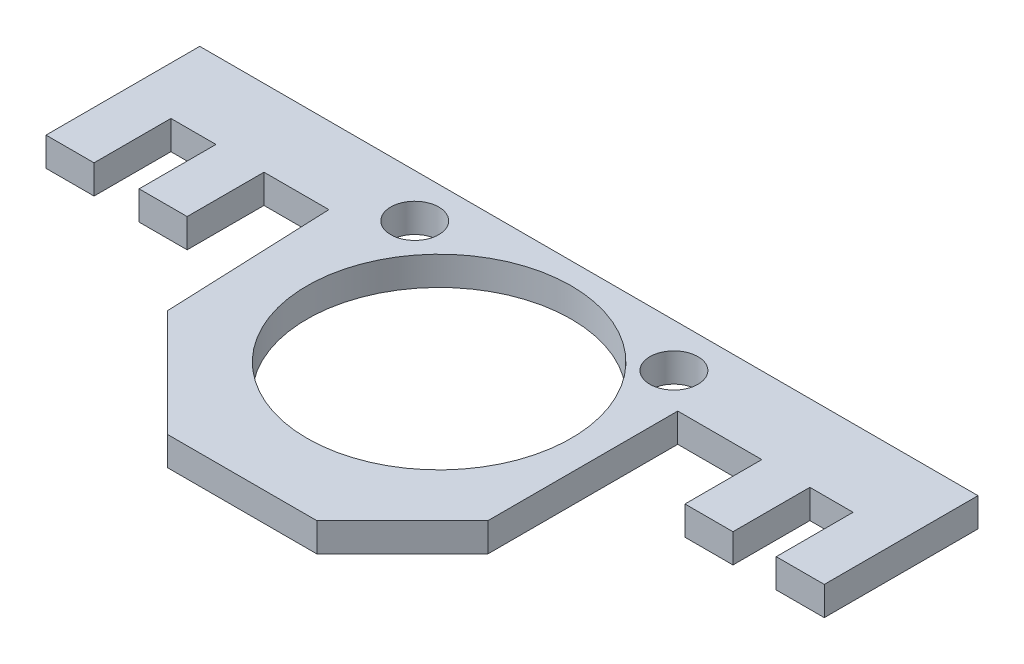
ISO-10303-21;
HEADER;
FILE_DESCRIPTION(('STEP AP214'),'2;1');
FILE_NAME('part.step','',(''),(''),'','','');
FILE_SCHEMA(('AUTOMOTIVE_DESIGN { 1 0 10303 214 1 1 1 1 }'));
ENDSEC;
DATA;
#1=APPLICATION_CONTEXT('core data for automotive mechanical design processes');
#2=APPLICATION_PROTOCOL_DEFINITION('international standard','automotive_design',2000,#1);
#3=PRODUCT_CONTEXT('',#1,'mechanical');
#4=PRODUCT('Part','Part','',(#3));
#5=PRODUCT_RELATED_PRODUCT_CATEGORY('part','',(#4));
#6=PRODUCT_DEFINITION_FORMATION('','',#4);
#7=PRODUCT_DEFINITION_CONTEXT('part definition',#1,'design');
#8=PRODUCT_DEFINITION('design','',#6,#7);
#9=PRODUCT_DEFINITION_SHAPE('','',#8);
#10=(LENGTH_UNIT() NAMED_UNIT(*) SI_UNIT(.MILLI.,.METRE.));
#11=(NAMED_UNIT(*) PLANE_ANGLE_UNIT() SI_UNIT($,.RADIAN.));
#12=(NAMED_UNIT(*) SI_UNIT($,.STERADIAN.) SOLID_ANGLE_UNIT());
#13=UNCERTAINTY_MEASURE_WITH_UNIT(LENGTH_MEASURE(1.E-05),#10,'distance_accuracy_value','');
#14=(GEOMETRIC_REPRESENTATION_CONTEXT(3) GLOBAL_UNCERTAINTY_ASSIGNED_CONTEXT((#13)) GLOBAL_UNIT_ASSIGNED_CONTEXT((#10,
#11,#12)) REPRESENTATION_CONTEXT('',''));
#15=CARTESIAN_POINT('',(0.,0.,0.));
#16=DIRECTION('',(0.,0.,1.));
#17=DIRECTION('',(1.,0.,0.));
#18=AXIS2_PLACEMENT_3D('',#15,#16,#17);
#19=CARTESIAN_POINT('',(-54.5898693639006,1.2,-21.7003312481757));
#20=DIRECTION('',(1.,0.,0.));
#21=DIRECTION('',(0.,0.,-1.));
#22=AXIS2_PLACEMENT_3D('',#19,#20,#21);
#23=PLANE('',#22);
#24=DIRECTION('',(0.,0.,1.));
#25=VECTOR('',#24,1.);
#26=CARTESIAN_POINT('',(-54.5898693639006,0.,-21.7003312481757));
#27=LINE('',#26,#25);
#28=CARTESIAN_POINT('',(-54.5898693639006,0.,-21.7003312481757));
#29=VERTEX_POINT('',#28);
#30=CARTESIAN_POINT('',(-54.5898693639006,0.,-15.3003312481757));
#31=VERTEX_POINT('',#30);
#32=EDGE_CURVE('E212',#29,#31,#27,.T.);
#33=ORIENTED_EDGE('',*,*,#32,.T.);
#34=DIRECTION('',(0.,-1.,0.));
#35=VECTOR('',#34,1.);
#36=CARTESIAN_POINT('',(-54.5898693639006,1.2,-15.3003312481757));
#37=LINE('',#36,#35);
#38=CARTESIAN_POINT('',(-54.5898693639006,1.2,-15.3003312481757));
#39=VERTEX_POINT('',#38);
#40=EDGE_CURVE('E11',#39,#31,#37,.T.);
#41=ORIENTED_EDGE('',*,*,#40,.F.);
#42=DIRECTION('',(0.,0.,1.));
#43=VECTOR('',#42,1.);
#44=CARTESIAN_POINT('',(-54.5898693639006,1.2,-21.7003312481757));
#45=LINE('',#44,#43);
#46=CARTESIAN_POINT('',(-54.5898693639006,1.2,-21.7003312481757));
#47=VERTEX_POINT('',#46);
#48=EDGE_CURVE('E255',#47,#39,#45,.T.);
#49=ORIENTED_EDGE('',*,*,#48,.F.);
#50=DIRECTION('',(0.,-1.,0.));
#51=VECTOR('',#50,1.);
#52=CARTESIAN_POINT('',(-54.5898693639006,1.2,-21.7003312481757));
#53=LINE('',#52,#51);
#54=EDGE_CURVE('E208',#47,#29,#53,.T.);
#55=ORIENTED_EDGE('',*,*,#54,.T.);
#56=EDGE_LOOP('',(#33,#41,#49,#55));
#57=FACE_BOUND('',#56,.T.);
#58=ADVANCED_FACE('F32',(#57),#23,.F.);
#59=CARTESIAN_POINT('',(-54.5898693639006,1.2,-15.3003312481757));
#60=DIRECTION('',(0.,0.,-1.));
#61=DIRECTION('',(-1.,0.,0.));
#62=AXIS2_PLACEMENT_3D('',#59,#60,#61);
#63=PLANE('',#62);
#64=DIRECTION('',(1.,0.,0.));
#65=VECTOR('',#64,1.);
#66=CARTESIAN_POINT('',(-54.5898693639006,0.,-15.3003312481757));
#67=LINE('',#66,#65);
#68=CARTESIAN_POINT('',(-52.5898693639006,0.,-15.3003312481757));
#69=VERTEX_POINT('',#68);
#70=EDGE_CURVE('E215',#31,#69,#67,.T.);
#71=ORIENTED_EDGE('',*,*,#70,.T.);
#72=DIRECTION('',(0.,-1.,0.));
#73=VECTOR('',#72,1.);
#74=CARTESIAN_POINT('',(-52.5898693639006,1.2,-15.3003312481757));
#75=LINE('',#74,#73);
#76=CARTESIAN_POINT('',(-52.5898693639006,1.2,-15.3003312481757));
#77=VERTEX_POINT('',#76);
#78=EDGE_CURVE('E40',#77,#69,#75,.T.);
#79=ORIENTED_EDGE('',*,*,#78,.F.);
#80=DIRECTION('',(1.,0.,0.));
#81=VECTOR('',#80,1.);
#82=CARTESIAN_POINT('',(-54.5898693639006,1.2,-15.3003312481757));
#83=LINE('',#82,#81);
#84=EDGE_CURVE('E133',#39,#77,#83,.T.);
#85=ORIENTED_EDGE('',*,*,#84,.F.);
#86=ORIENTED_EDGE('',*,*,#40,.T.);
#87=EDGE_LOOP('',(#71,#79,#85,#86));
#88=FACE_BOUND('',#87,.T.);
#89=ADVANCED_FACE('F384',(#88),#63,.F.);
#90=CARTESIAN_POINT('',(-52.5898693639006,1.2,-15.3003312481757));
#91=DIRECTION('',(-1.,0.,0.));
#92=DIRECTION('',(0.,0.,1.));
#93=AXIS2_PLACEMENT_3D('',#90,#91,#92);
#94=PLANE('',#93);
#95=DIRECTION('',(0.,0.,-1.));
#96=VECTOR('',#95,1.);
#97=CARTESIAN_POINT('',(-52.5898693639006,0.,-15.3003312481757));
#98=LINE('',#97,#96);
#99=CARTESIAN_POINT('',(-52.5898693639006,0.,-18.5003312481757));
#100=VERTEX_POINT('',#99);
#101=EDGE_CURVE('E218',#69,#100,#98,.T.);
#102=ORIENTED_EDGE('',*,*,#101,.T.);
#103=DIRECTION('',(0.,-1.,0.));
#104=VECTOR('',#103,1.);
#105=CARTESIAN_POINT('',(-52.5898693639006,1.2,-18.5003312481757));
#106=LINE('',#105,#104);
#107=CARTESIAN_POINT('',(-52.5898693639006,1.2,-18.5003312481757));
#108=VERTEX_POINT('',#107);
#109=EDGE_CURVE('E304',#108,#100,#106,.T.);
#110=ORIENTED_EDGE('',*,*,#109,.F.);
#111=DIRECTION('',(0.,0.,-1.));
#112=VECTOR('',#111,1.);
#113=CARTESIAN_POINT('',(-52.5898693639006,1.2,-15.3003312481757));
#114=LINE('',#113,#112);
#115=EDGE_CURVE('E312',#77,#108,#114,.T.);
#116=ORIENTED_EDGE('',*,*,#115,.F.);
#117=ORIENTED_EDGE('',*,*,#78,.T.);
#118=EDGE_LOOP('',(#102,#110,#116,#117));
#119=FACE_BOUND('',#118,.T.);
#120=ADVANCED_FACE('F310',(#119),#94,.F.);
#121=CARTESIAN_POINT('',(-52.5898693639006,1.2,-18.5003312481757));
#122=DIRECTION('',(0.,0.,-1.));
#123=DIRECTION('',(-1.,0.,0.));
#124=AXIS2_PLACEMENT_3D('',#121,#122,#123);
#125=PLANE('',#124);
#126=DIRECTION('',(1.,0.,0.));
#127=VECTOR('',#126,1.);
#128=CARTESIAN_POINT('',(-52.5898693639006,0.,-18.5003312481757));
#129=LINE('',#128,#127);
#130=CARTESIAN_POINT('',(-50.7139819287559,0.,-18.5003312481757));
#131=VERTEX_POINT('',#130);
#132=EDGE_CURVE('E220',#100,#131,#129,.T.);
#133=ORIENTED_EDGE('',*,*,#132,.T.);
#134=DIRECTION('',(0.,-1.,0.));
#135=VECTOR('',#134,1.);
#136=CARTESIAN_POINT('',(-50.7139819287559,1.2,-18.5003312481757));
#137=LINE('',#136,#135);
#138=CARTESIAN_POINT('',(-50.7139819287559,1.2,-18.5003312481757));
#139=VERTEX_POINT('',#138);
#140=EDGE_CURVE('E301',#139,#131,#137,.T.);
#141=ORIENTED_EDGE('',*,*,#140,.F.);
#142=DIRECTION('',(1.,0.,0.));
#143=VECTOR('',#142,1.);
#144=CARTESIAN_POINT('',(-52.5898693639006,1.2,-18.5003312481757));
#145=LINE('',#144,#143);
#146=EDGE_CURVE('E330',#108,#139,#145,.T.);
#147=ORIENTED_EDGE('',*,*,#146,.F.);
#148=ORIENTED_EDGE('',*,*,#109,.T.);
#149=EDGE_LOOP('',(#133,#141,#147,#148));
#150=FACE_BOUND('',#149,.T.);
#151=ADVANCED_FACE('F321',(#150),#125,.F.);
#152=CARTESIAN_POINT('',(-50.7139819287559,1.2,-18.5003312481757));
#153=DIRECTION('',(1.,0.,0.));
#154=DIRECTION('',(0.,0.,-1.));
#155=AXIS2_PLACEMENT_3D('',#152,#153,#154);
#156=PLANE('',#155);
#157=DIRECTION('',(0.,0.,1.));
#158=VECTOR('',#157,1.);
#159=CARTESIAN_POINT('',(-50.7139819287559,0.,-18.5003312481757));
#160=LINE('',#159,#158);
#161=CARTESIAN_POINT('',(-50.7139819287559,0.,-15.3003312481757));
#162=VERTEX_POINT('',#161);
#163=EDGE_CURVE('E222',#131,#162,#160,.T.);
#164=ORIENTED_EDGE('',*,*,#163,.T.);
#165=DIRECTION('',(0.,-1.,0.));
#166=VECTOR('',#165,1.);
#167=CARTESIAN_POINT('',(-50.7139819287559,1.2,-15.3003312481757));
#168=LINE('',#167,#166);
#169=CARTESIAN_POINT('',(-50.7139819287559,1.2,-15.3003312481757));
#170=VERTEX_POINT('',#169);
#171=EDGE_CURVE('E298',#170,#162,#168,.T.);
#172=ORIENTED_EDGE('',*,*,#171,.F.);
#173=DIRECTION('',(0.,0.,1.));
#174=VECTOR('',#173,1.);
#175=CARTESIAN_POINT('',(-50.7139819287559,1.2,-18.5003312481757));
#176=LINE('',#175,#174);
#177=EDGE_CURVE('E327',#139,#170,#176,.T.);
#178=ORIENTED_EDGE('',*,*,#177,.F.);
#179=ORIENTED_EDGE('',*,*,#140,.T.);
#180=EDGE_LOOP('',(#164,#172,#178,#179));
#181=FACE_BOUND('',#180,.T.);
#182=ADVANCED_FACE('F325',(#181),#156,.F.);
#183=CARTESIAN_POINT('',(-50.7139819287559,1.2,-15.3003312481757));
#184=DIRECTION('',(0.,0.,-1.));
#185=DIRECTION('',(-1.,0.,0.));
#186=AXIS2_PLACEMENT_3D('',#183,#184,#185);
#187=PLANE('',#186);
#188=DIRECTION('',(1.,0.,0.));
#189=VECTOR('',#188,1.);
#190=CARTESIAN_POINT('',(-50.7139819287559,0.,-15.3003312481757));
#191=LINE('',#190,#189);
#192=CARTESIAN_POINT('',(-48.7139819287559,0.,-15.3003312481757));
#193=VERTEX_POINT('',#192);
#194=EDGE_CURVE('E224',#162,#193,#191,.T.);
#195=ORIENTED_EDGE('',*,*,#194,.T.);
#196=DIRECTION('',(0.,-1.,0.));
#197=VECTOR('',#196,1.);
#198=CARTESIAN_POINT('',(-48.7139819287559,1.2,-15.3003312481757));
#199=LINE('',#198,#197);
#200=CARTESIAN_POINT('',(-48.7139819287559,1.2,-15.3003312481757));
#201=VERTEX_POINT('',#200);
#202=EDGE_CURVE('E295',#201,#193,#199,.T.);
#203=ORIENTED_EDGE('',*,*,#202,.F.);
#204=DIRECTION('',(1.,0.,0.));
#205=VECTOR('',#204,1.);
#206=CARTESIAN_POINT('',(-50.7139819287559,1.2,-15.3003312481757));
#207=LINE('',#206,#205);
#208=EDGE_CURVE('E329',#170,#201,#207,.T.);
#209=ORIENTED_EDGE('',*,*,#208,.F.);
#210=ORIENTED_EDGE('',*,*,#171,.T.);
#211=EDGE_LOOP('',(#195,#203,#209,#210));
#212=FACE_BOUND('',#211,.T.);
#213=ADVANCED_FACE('F397',(#212),#187,.F.);
#214=CARTESIAN_POINT('',(-48.7139819287559,1.2,-15.3003312481757));
#215=DIRECTION('',(-1.,0.,0.));
#216=DIRECTION('',(0.,0.,1.));
#217=AXIS2_PLACEMENT_3D('',#214,#215,#216);
#218=PLANE('',#217);
#219=DIRECTION('',(0.,0.,-1.));
#220=VECTOR('',#219,1.);
#221=CARTESIAN_POINT('',(-48.7139819287559,0.,-15.3003312481757));
#222=LINE('',#221,#220);
#223=CARTESIAN_POINT('',(-48.7139819287559,0.,-18.5003312481757));
#224=VERTEX_POINT('',#223);
#225=EDGE_CURVE('E226',#193,#224,#222,.T.);
#226=ORIENTED_EDGE('',*,*,#225,.T.);
#227=DIRECTION('',(0.,-1.,0.));
#228=VECTOR('',#227,1.);
#229=CARTESIAN_POINT('',(-48.7139819287559,1.2,-18.5003312481757));
#230=LINE('',#229,#228);
#231=CARTESIAN_POINT('',(-48.7139819287559,1.2,-18.5003312481757));
#232=VERTEX_POINT('',#231);
#233=EDGE_CURVE('E292',#232,#224,#230,.T.);
#234=ORIENTED_EDGE('',*,*,#233,.F.);
#235=DIRECTION('',(0.,0.,-1.));
#236=VECTOR('',#235,1.);
#237=CARTESIAN_POINT('',(-48.7139819287559,1.2,-15.3003312481757));
#238=LINE('',#237,#236);
#239=EDGE_CURVE('E332',#201,#232,#238,.T.);
#240=ORIENTED_EDGE('',*,*,#239,.F.);
#241=ORIENTED_EDGE('',*,*,#202,.T.);
#242=EDGE_LOOP('',(#226,#234,#240,#241));
#243=FACE_BOUND('',#242,.T.);
#244=ADVANCED_FACE('F400',(#243),#218,.F.);
#245=CARTESIAN_POINT('',(-48.7139819287559,1.2,-18.5003312481757));
#246=DIRECTION('',(0.,0.,-1.));
#247=DIRECTION('',(-1.,0.,0.));
#248=AXIS2_PLACEMENT_3D('',#245,#246,#247);
#249=PLANE('',#248);
#250=DIRECTION('',(1.,0.,0.));
#251=VECTOR('',#250,1.);
#252=CARTESIAN_POINT('',(-48.7139819287559,0.,-18.5003312481757));
#253=LINE('',#252,#251);
#254=CARTESIAN_POINT('',(-46.0139819287559,0.,-18.5003312481757));
#255=VERTEX_POINT('',#254);
#256=EDGE_CURVE('E228',#224,#255,#253,.T.);
#257=ORIENTED_EDGE('',*,*,#256,.T.);
#258=DIRECTION('',(0.,-1.,0.));
#259=VECTOR('',#258,1.);
#260=CARTESIAN_POINT('',(-46.0139819287559,1.2,-18.5003312481757));
#261=LINE('',#260,#259);
#262=CARTESIAN_POINT('',(-46.0139819287559,1.2,-18.5003312481757));
#263=VERTEX_POINT('',#262);
#264=EDGE_CURVE('E289',#263,#255,#261,.T.);
#265=ORIENTED_EDGE('',*,*,#264,.F.);
#266=DIRECTION('',(1.,0.,0.));
#267=VECTOR('',#266,1.);
#268=CARTESIAN_POINT('',(-48.7139819287559,1.2,-18.5003312481757));
#269=LINE('',#268,#267);
#270=EDGE_CURVE('E338',#232,#263,#269,.T.);
#271=ORIENTED_EDGE('',*,*,#270,.F.);
#272=ORIENTED_EDGE('',*,*,#233,.T.);
#273=EDGE_LOOP('',(#257,#265,#271,#272));
#274=FACE_BOUND('',#273,.T.);
#275=ADVANCED_FACE('F404',(#274),#249,.F.);
#276=CARTESIAN_POINT('',(-45.7284602625563,1.2,-11.4912857924708));
#277=DIRECTION('',(0.999171313454224,0.,-0.0407024123383468));
#278=DIRECTION('',(-0.0407024123383468,0.,-0.999171313454224));
#279=AXIS2_PLACEMENT_3D('',#276,#277,#278);
#280=PLANE('',#279);
#281=DIRECTION('',(0.0407024123383468,0.,0.999171313454224));
#282=VECTOR('',#281,1.);
#283=CARTESIAN_POINT('',(-45.7284602625563,0.,-11.4912857924708));
#284=LINE('',#283,#282);
#285=CARTESIAN_POINT('',(-45.7284602625563,0.,-11.4912857924708));
#286=VERTEX_POINT('',#285);
#287=EDGE_CURVE('E230',#255,#286,#284,.T.);
#288=ORIENTED_EDGE('',*,*,#287,.T.);
#289=DIRECTION('',(0.,-1.,0.));
#290=VECTOR('',#289,1.);
#291=CARTESIAN_POINT('',(-45.7284602625563,1.2,-11.4912857924708));
#292=LINE('',#291,#290);
#293=CARTESIAN_POINT('',(-45.7284602625563,1.2,-11.4912857924708));
#294=VERTEX_POINT('',#293);
#295=EDGE_CURVE('E286',#294,#286,#292,.T.);
#296=ORIENTED_EDGE('',*,*,#295,.F.);
#297=DIRECTION('',(0.0407024123383468,0.,0.999171313454224));
#298=VECTOR('',#297,1.);
#299=CARTESIAN_POINT('',(-45.7284602625563,1.2,-11.4912857924708));
#300=LINE('',#299,#298);
#301=EDGE_CURVE('E340',#263,#294,#300,.T.);
#302=ORIENTED_EDGE('',*,*,#301,.F.);
#303=ORIENTED_EDGE('',*,*,#264,.T.);
#304=EDGE_LOOP('',(#288,#296,#302,#303));
#305=FACE_BOUND('',#304,.T.);
#306=ADVANCED_FACE('F408',(#305),#280,.F.);
#307=CARTESIAN_POINT('',(-41.273687541081,1.2,-7.03651307099554));
#308=DIRECTION('',(0.707106781186545,0.,-0.70710678118655));
#309=DIRECTION('',(-0.70710678118655,0.,-0.707106781186545));
#310=AXIS2_PLACEMENT_3D('',#307,#308,#309);
#311=PLANE('',#310);
#312=DIRECTION('',(0.70710678118655,0.,0.707106781186545));
#313=VECTOR('',#312,1.);
#314=CARTESIAN_POINT('',(-41.273687541081,0.,-7.03651307099554));
#315=LINE('',#314,#313);
#316=CARTESIAN_POINT('',(-41.273687541081,0.,-7.03651307099554));
#317=VERTEX_POINT('',#316);
#318=EDGE_CURVE('E232',#286,#317,#315,.T.);
#319=ORIENTED_EDGE('',*,*,#318,.T.);
#320=DIRECTION('',(0.,-1.,0.));
#321=VECTOR('',#320,1.);
#322=CARTESIAN_POINT('',(-41.273687541081,1.2,-7.03651307099554));
#323=LINE('',#322,#321);
#324=CARTESIAN_POINT('',(-41.273687541081,1.2,-7.03651307099554));
#325=VERTEX_POINT('',#324);
#326=EDGE_CURVE('E283',#325,#317,#323,.T.);
#327=ORIENTED_EDGE('',*,*,#326,.F.);
#328=DIRECTION('',(0.70710678118655,0.,0.707106781186545));
#329=VECTOR('',#328,1.);
#330=CARTESIAN_POINT('',(-41.273687541081,1.2,-7.03651307099554));
#331=LINE('',#330,#329);
#332=EDGE_CURVE('E342',#294,#325,#331,.T.);
#333=ORIENTED_EDGE('',*,*,#332,.F.);
#334=ORIENTED_EDGE('',*,*,#295,.T.);
#335=EDGE_LOOP('',(#319,#327,#333,#334));
#336=FACE_BOUND('',#335,.T.);
#337=ADVANCED_FACE('F412',(#336),#311,.F.);
#338=CARTESIAN_POINT('',(-35.0536875410808,1.2,-7.03651307099554));
#339=DIRECTION('',(0.,0.,-1.));
#340=DIRECTION('',(-1.,0.,0.));
#341=AXIS2_PLACEMENT_3D('',#338,#339,#340);
#342=PLANE('',#341);
#343=DIRECTION('',(1.,0.,0.));
#344=VECTOR('',#343,1.);
#345=CARTESIAN_POINT('',(-35.0536875410808,0.,-7.03651307099554));
#346=LINE('',#345,#344);
#347=CARTESIAN_POINT('',(-35.0536875410808,0.,-7.03651307099554));
#348=VERTEX_POINT('',#347);
#349=EDGE_CURVE('E234',#317,#348,#346,.T.);
#350=ORIENTED_EDGE('',*,*,#349,.T.);
#351=DIRECTION('',(0.,-1.,0.));
#352=VECTOR('',#351,1.);
#353=CARTESIAN_POINT('',(-35.0536875410808,1.2,-7.03651307099554));
#354=LINE('',#353,#352);
#355=CARTESIAN_POINT('',(-35.0536875410808,1.2,-7.03651307099554));
#356=VERTEX_POINT('',#355);
#357=EDGE_CURVE('E280',#356,#348,#354,.T.);
#358=ORIENTED_EDGE('',*,*,#357,.F.);
#359=DIRECTION('',(1.,0.,0.));
#360=VECTOR('',#359,1.);
#361=CARTESIAN_POINT('',(-35.0536875410808,1.2,-7.03651307099554));
#362=LINE('',#361,#360);
#363=EDGE_CURVE('E344',#325,#356,#362,.T.);
#364=ORIENTED_EDGE('',*,*,#363,.F.);
#365=ORIENTED_EDGE('',*,*,#326,.T.);
#366=EDGE_LOOP('',(#350,#358,#364,#365));
#367=FACE_BOUND('',#366,.T.);
#368=ADVANCED_FACE('F416',(#367),#342,.F.);
#369=CARTESIAN_POINT('',(-31.4898693639006,1.2,-10.6003312481757));
#370=DIRECTION('',(-0.707106781186547,0.,-0.707106781186548));
#371=DIRECTION('',(-0.707106781186548,0.,0.707106781186547));
#372=AXIS2_PLACEMENT_3D('',#369,#370,#371);
#373=PLANE('',#372);
#374=DIRECTION('',(0.707106781186548,0.,-0.707106781186547));
#375=VECTOR('',#374,1.);
#376=CARTESIAN_POINT('',(-31.4898693639006,0.,-10.6003312481757));
#377=LINE('',#376,#375);
#378=CARTESIAN_POINT('',(-31.4898693639006,0.,-10.6003312481757));
#379=VERTEX_POINT('',#378);
#380=EDGE_CURVE('E236',#348,#379,#377,.T.);
#381=ORIENTED_EDGE('',*,*,#380,.T.);
#382=DIRECTION('',(0.,-1.,0.));
#383=VECTOR('',#382,1.);
#384=CARTESIAN_POINT('',(-31.4898693639006,1.2,-10.6003312481757));
#385=LINE('',#384,#383);
#386=CARTESIAN_POINT('',(-31.4898693639006,1.2,-10.6003312481757));
#387=VERTEX_POINT('',#386);
#388=EDGE_CURVE('E277',#387,#379,#385,.T.);
#389=ORIENTED_EDGE('',*,*,#388,.F.);
#390=DIRECTION('',(0.707106781186548,0.,-0.707106781186547));
#391=VECTOR('',#390,1.);
#392=CARTESIAN_POINT('',(-31.4898693639006,1.2,-10.6003312481757));
#393=LINE('',#392,#391);
#394=EDGE_CURVE('E346',#356,#387,#393,.T.);
#395=ORIENTED_EDGE('',*,*,#394,.F.);
#396=ORIENTED_EDGE('',*,*,#357,.T.);
#397=EDGE_LOOP('',(#381,#389,#395,#396));
#398=FACE_BOUND('',#397,.T.);
#399=ADVANCED_FACE('F420',(#398),#373,.F.);
#400=CARTESIAN_POINT('',(-31.4898693639006,1.2,-18.5003312481757));
#401=DIRECTION('',(-1.,0.,0.));
#402=DIRECTION('',(0.,0.,1.));
#403=AXIS2_PLACEMENT_3D('',#400,#401,#402);
#404=PLANE('',#403);
#405=DIRECTION('',(0.,0.,-1.));
#406=VECTOR('',#405,1.);
#407=CARTESIAN_POINT('',(-31.4898693639006,0.,-18.5003312481757));
#408=LINE('',#407,#406);
#409=CARTESIAN_POINT('',(-31.4898693639006,0.,-18.5003312481757));
#410=VERTEX_POINT('',#409);
#411=EDGE_CURVE('E238',#379,#410,#408,.T.);
#412=ORIENTED_EDGE('',*,*,#411,.T.);
#413=DIRECTION('',(0.,-1.,0.));
#414=VECTOR('',#413,1.);
#415=CARTESIAN_POINT('',(-31.4898693639006,1.2,-18.5003312481757));
#416=LINE('',#415,#414);
#417=CARTESIAN_POINT('',(-31.4898693639006,1.2,-18.5003312481757));
#418=VERTEX_POINT('',#417);
#419=EDGE_CURVE('E274',#418,#410,#416,.T.);
#420=ORIENTED_EDGE('',*,*,#419,.F.);
#421=DIRECTION('',(0.,0.,-1.));
#422=VECTOR('',#421,1.);
#423=CARTESIAN_POINT('',(-31.4898693639006,1.2,-18.5003312481757));
#424=LINE('',#423,#422);
#425=EDGE_CURVE('E348',#387,#418,#424,.T.);
#426=ORIENTED_EDGE('',*,*,#425,.F.);
#427=ORIENTED_EDGE('',*,*,#388,.T.);
#428=EDGE_LOOP('',(#412,#420,#426,#427));
#429=FACE_BOUND('',#428,.T.);
#430=ADVANCED_FACE('F424',(#429),#404,.F.);
#431=CARTESIAN_POINT('',(-27.9898693639006,1.2,-18.5003312481757));
#432=DIRECTION('',(0.,0.,-1.));
#433=DIRECTION('',(-1.,0.,0.));
#434=AXIS2_PLACEMENT_3D('',#431,#432,#433);
#435=PLANE('',#434);
#436=DIRECTION('',(1.,0.,0.));
#437=VECTOR('',#436,1.);
#438=CARTESIAN_POINT('',(-27.9898693639006,0.,-18.5003312481757));
#439=LINE('',#438,#437);
#440=CARTESIAN_POINT('',(-27.9898693639006,0.,-18.5003312481757));
#441=VERTEX_POINT('',#440);
#442=EDGE_CURVE('E240',#410,#441,#439,.T.);
#443=ORIENTED_EDGE('',*,*,#442,.T.);
#444=DIRECTION('',(0.,-1.,0.));
#445=VECTOR('',#444,1.);
#446=CARTESIAN_POINT('',(-27.9898693639006,1.2,-18.5003312481757));
#447=LINE('',#446,#445);
#448=CARTESIAN_POINT('',(-27.9898693639006,1.2,-18.5003312481757));
#449=VERTEX_POINT('',#448);
#450=EDGE_CURVE('E271',#449,#441,#447,.T.);
#451=ORIENTED_EDGE('',*,*,#450,.F.);
#452=DIRECTION('',(1.,0.,0.));
#453=VECTOR('',#452,1.);
#454=CARTESIAN_POINT('',(-27.9898693639006,1.2,-18.5003312481757));
#455=LINE('',#454,#453);
#456=EDGE_CURVE('E350',#418,#449,#455,.T.);
#457=ORIENTED_EDGE('',*,*,#456,.F.);
#458=ORIENTED_EDGE('',*,*,#419,.T.);
#459=EDGE_LOOP('',(#443,#451,#457,#458));
#460=FACE_BOUND('',#459,.T.);
#461=ADVANCED_FACE('F428',(#460),#435,.F.);
#462=CARTESIAN_POINT('',(-27.9898693639006,1.2,-15.3003312481757));
#463=DIRECTION('',(1.,0.,0.));
#464=DIRECTION('',(0.,0.,-1.));
#465=AXIS2_PLACEMENT_3D('',#462,#463,#464);
#466=PLANE('',#465);
#467=DIRECTION('',(0.,0.,1.));
#468=VECTOR('',#467,1.);
#469=CARTESIAN_POINT('',(-27.9898693639006,0.,-15.3003312481757));
#470=LINE('',#469,#468);
#471=CARTESIAN_POINT('',(-27.9898693639006,0.,-15.3003312481757));
#472=VERTEX_POINT('',#471);
#473=EDGE_CURVE('E242',#441,#472,#470,.T.);
#474=ORIENTED_EDGE('',*,*,#473,.T.);
#475=DIRECTION('',(0.,-1.,0.));
#476=VECTOR('',#475,1.);
#477=CARTESIAN_POINT('',(-27.9898693639006,1.2,-15.3003312481757));
#478=LINE('',#477,#476);
#479=CARTESIAN_POINT('',(-27.9898693639006,1.2,-15.3003312481757));
#480=VERTEX_POINT('',#479);
#481=EDGE_CURVE('E268',#480,#472,#478,.T.);
#482=ORIENTED_EDGE('',*,*,#481,.F.);
#483=DIRECTION('',(0.,0.,1.));
#484=VECTOR('',#483,1.);
#485=CARTESIAN_POINT('',(-27.9898693639006,1.2,-15.3003312481757));
#486=LINE('',#485,#484);
#487=EDGE_CURVE('E352',#449,#480,#486,.T.);
#488=ORIENTED_EDGE('',*,*,#487,.F.);
#489=ORIENTED_EDGE('',*,*,#450,.T.);
#490=EDGE_LOOP('',(#474,#482,#488,#489));
#491=FACE_BOUND('',#490,.T.);
#492=ADVANCED_FACE('F432',(#491),#466,.F.);
#493=CARTESIAN_POINT('',(-25.9898693639006,1.2,-15.3003312481757));
#494=DIRECTION('',(0.,0.,-1.));
#495=DIRECTION('',(-1.,0.,0.));
#496=AXIS2_PLACEMENT_3D('',#493,#494,#495);
#497=PLANE('',#496);
#498=DIRECTION('',(1.,0.,0.));
#499=VECTOR('',#498,1.);
#500=CARTESIAN_POINT('',(-25.9898693639006,0.,-15.3003312481757));
#501=LINE('',#500,#499);
#502=CARTESIAN_POINT('',(-25.9898693639006,0.,-15.3003312481757));
#503=VERTEX_POINT('',#502);
#504=EDGE_CURVE('E244',#472,#503,#501,.T.);
#505=ORIENTED_EDGE('',*,*,#504,.T.);
#506=DIRECTION('',(0.,-1.,0.));
#507=VECTOR('',#506,1.);
#508=CARTESIAN_POINT('',(-25.9898693639006,1.2,-15.3003312481757));
#509=LINE('',#508,#507);
#510=CARTESIAN_POINT('',(-25.9898693639006,1.2,-15.3003312481757));
#511=VERTEX_POINT('',#510);
#512=EDGE_CURVE('E265',#511,#503,#509,.T.);
#513=ORIENTED_EDGE('',*,*,#512,.F.);
#514=DIRECTION('',(1.,0.,0.));
#515=VECTOR('',#514,1.);
#516=CARTESIAN_POINT('',(-25.9898693639006,1.2,-15.3003312481757));
#517=LINE('',#516,#515);
#518=EDGE_CURVE('E354',#480,#511,#517,.T.);
#519=ORIENTED_EDGE('',*,*,#518,.F.);
#520=ORIENTED_EDGE('',*,*,#481,.T.);
#521=EDGE_LOOP('',(#505,#513,#519,#520));
#522=FACE_BOUND('',#521,.T.);
#523=ADVANCED_FACE('F436',(#522),#497,.F.);
#524=CARTESIAN_POINT('',(-25.9898693639006,1.2,-18.5003312481757));
#525=DIRECTION('',(-1.,0.,0.));
#526=DIRECTION('',(0.,0.,1.));
#527=AXIS2_PLACEMENT_3D('',#524,#525,#526);
#528=PLANE('',#527);
#529=DIRECTION('',(0.,0.,-1.));
#530=VECTOR('',#529,1.);
#531=CARTESIAN_POINT('',(-25.9898693639006,0.,-18.5003312481757));
#532=LINE('',#531,#530);
#533=CARTESIAN_POINT('',(-25.9898693639006,0.,-18.5003312481757));
#534=VERTEX_POINT('',#533);
#535=EDGE_CURVE('E246',#503,#534,#532,.T.);
#536=ORIENTED_EDGE('',*,*,#535,.T.);
#537=DIRECTION('',(0.,-1.,0.));
#538=VECTOR('',#537,1.);
#539=CARTESIAN_POINT('',(-25.9898693639006,1.2,-18.5003312481757));
#540=LINE('',#539,#538);
#541=CARTESIAN_POINT('',(-25.9898693639006,1.2,-18.5003312481757));
#542=VERTEX_POINT('',#541);
#543=EDGE_CURVE('E262',#542,#534,#540,.T.);
#544=ORIENTED_EDGE('',*,*,#543,.F.);
#545=DIRECTION('',(0.,0.,-1.));
#546=VECTOR('',#545,1.);
#547=CARTESIAN_POINT('',(-25.9898693639006,1.2,-18.5003312481757));
#548=LINE('',#547,#546);
#549=EDGE_CURVE('E356',#511,#542,#548,.T.);
#550=ORIENTED_EDGE('',*,*,#549,.F.);
#551=ORIENTED_EDGE('',*,*,#512,.T.);
#552=EDGE_LOOP('',(#536,#544,#550,#551));
#553=FACE_BOUND('',#552,.T.);
#554=ADVANCED_FACE('F440',(#553),#528,.F.);
#555=CARTESIAN_POINT('',(-24.1898693639006,1.2,-18.5003312481757));
#556=DIRECTION('',(0.,0.,-1.));
#557=DIRECTION('',(-1.,0.,0.));
#558=AXIS2_PLACEMENT_3D('',#555,#556,#557);
#559=PLANE('',#558);
#560=DIRECTION('',(1.,0.,0.));
#561=VECTOR('',#560,1.);
#562=CARTESIAN_POINT('',(-24.1898693639006,0.,-18.5003312481757));
#563=LINE('',#562,#561);
#564=CARTESIAN_POINT('',(-24.1898693639006,0.,-18.5003312481757));
#565=VERTEX_POINT('',#564);
#566=EDGE_CURVE('E248',#534,#565,#563,.T.);
#567=ORIENTED_EDGE('',*,*,#566,.T.);
#568=DIRECTION('',(0.,-1.,0.));
#569=VECTOR('',#568,1.);
#570=CARTESIAN_POINT('',(-24.1898693639006,1.2,-18.5003312481757));
#571=LINE('',#570,#569);
#572=CARTESIAN_POINT('',(-24.1898693639006,1.2,-18.5003312481757));
#573=VERTEX_POINT('',#572);
#574=EDGE_CURVE('E259',#573,#565,#571,.T.);
#575=ORIENTED_EDGE('',*,*,#574,.F.);
#576=DIRECTION('',(1.,0.,0.));
#577=VECTOR('',#576,1.);
#578=CARTESIAN_POINT('',(-24.1898693639006,1.2,-18.5003312481757));
#579=LINE('',#578,#577);
#580=EDGE_CURVE('E358',#542,#573,#579,.T.);
#581=ORIENTED_EDGE('',*,*,#580,.F.);
#582=ORIENTED_EDGE('',*,*,#543,.T.);
#583=EDGE_LOOP('',(#567,#575,#581,#582));
#584=FACE_BOUND('',#583,.T.);
#585=ADVANCED_FACE('F364',(#584),#559,.F.);
#586=CARTESIAN_POINT('',(-24.1898693639006,1.2,-15.3003312481757));
#587=DIRECTION('',(1.,0.,0.));
#588=DIRECTION('',(0.,0.,-1.));
#589=AXIS2_PLACEMENT_3D('',#586,#587,#588);
#590=PLANE('',#589);
#591=DIRECTION('',(0.,0.,1.));
#592=VECTOR('',#591,1.);
#593=CARTESIAN_POINT('',(-24.1898693639006,0.,-15.3003312481757));
#594=LINE('',#593,#592);
#595=CARTESIAN_POINT('',(-24.1898693639006,0.,-15.3003312481757));
#596=VERTEX_POINT('',#595);
#597=EDGE_CURVE('E250',#565,#596,#594,.T.);
#598=ORIENTED_EDGE('',*,*,#597,.T.);
#599=DIRECTION('',(0.,-1.,0.));
#600=VECTOR('',#599,1.);
#601=CARTESIAN_POINT('',(-24.1898693639006,1.2,-15.3003312481757));
#602=LINE('',#601,#600);
#603=CARTESIAN_POINT('',(-24.1898693639006,1.2,-15.3003312481757));
#604=VERTEX_POINT('',#603);
#605=EDGE_CURVE('E203',#604,#596,#602,.T.);
#606=ORIENTED_EDGE('',*,*,#605,.F.);
#607=DIRECTION('',(0.,0.,1.));
#608=VECTOR('',#607,1.);
#609=CARTESIAN_POINT('',(-24.1898693639006,1.2,-15.3003312481757));
#610=LINE('',#609,#608);
#611=EDGE_CURVE('E194',#573,#604,#610,.T.);
#612=ORIENTED_EDGE('',*,*,#611,.F.);
#613=ORIENTED_EDGE('',*,*,#574,.T.);
#614=EDGE_LOOP('',(#598,#606,#612,#613));
#615=FACE_BOUND('',#614,.T.);
#616=ADVANCED_FACE('F368',(#615),#590,.F.);
#617=CARTESIAN_POINT('',(-22.1898693639006,1.2,-15.3003312481757));
#618=DIRECTION('',(0.,0.,-1.));
#619=DIRECTION('',(-1.,0.,0.));
#620=AXIS2_PLACEMENT_3D('',#617,#618,#619);
#621=PLANE('',#620);
#622=DIRECTION('',(1.,0.,0.));
#623=VECTOR('',#622,1.);
#624=CARTESIAN_POINT('',(-22.1898693639006,0.,-15.3003312481757));
#625=LINE('',#624,#623);
#626=CARTESIAN_POINT('',(-22.1898693639006,0.,-15.3003312481757));
#627=VERTEX_POINT('',#626);
#628=EDGE_CURVE('E202',#596,#627,#625,.T.);
#629=ORIENTED_EDGE('',*,*,#628,.T.);
#630=DIRECTION('',(0.,-1.,0.));
#631=VECTOR('',#630,1.);
#632=CARTESIAN_POINT('',(-22.1898693639006,1.2,-15.3003312481757));
#633=LINE('',#632,#631);
#634=CARTESIAN_POINT('',(-22.1898693639006,1.2,-15.3003312481757));
#635=VERTEX_POINT('',#634);
#636=EDGE_CURVE('E199',#635,#627,#633,.T.);
#637=ORIENTED_EDGE('',*,*,#636,.F.);
#638=DIRECTION('',(1.,0.,0.));
#639=VECTOR('',#638,1.);
#640=CARTESIAN_POINT('',(-22.1898693639006,1.2,-15.3003312481757));
#641=LINE('',#640,#639);
#642=EDGE_CURVE('E188',#604,#635,#641,.T.);
#643=ORIENTED_EDGE('',*,*,#642,.F.);
#644=ORIENTED_EDGE('',*,*,#605,.T.);
#645=EDGE_LOOP('',(#629,#637,#643,#644));
#646=FACE_BOUND('',#645,.T.);
#647=ADVANCED_FACE('F200',(#646),#621,.F.);
#648=CARTESIAN_POINT('',(-22.1898693639006,1.2,-21.7003312481757));
#649=DIRECTION('',(-1.,0.,0.));
#650=DIRECTION('',(0.,0.,1.));
#651=AXIS2_PLACEMENT_3D('',#648,#649,#650);
#652=PLANE('',#651);
#653=DIRECTION('',(0.,0.,-1.));
#654=VECTOR('',#653,1.);
#655=CARTESIAN_POINT('',(-22.1898693639006,0.,-21.7003312481757));
#656=LINE('',#655,#654);
#657=CARTESIAN_POINT('',(-22.1898693639006,0.,-21.7003312481757));
#658=VERTEX_POINT('',#657);
#659=EDGE_CURVE('E119',#627,#658,#656,.T.);
#660=ORIENTED_EDGE('',*,*,#659,.T.);
#661=DIRECTION('',(0.,-1.,0.));
#662=VECTOR('',#661,1.);
#663=CARTESIAN_POINT('',(-22.1898693639006,1.2,-21.7003312481757));
#664=LINE('',#663,#662);
#665=CARTESIAN_POINT('',(-22.1898693639006,1.2,-21.7003312481757));
#666=VERTEX_POINT('',#665);
#667=EDGE_CURVE('E204',#666,#658,#664,.T.);
#668=ORIENTED_EDGE('',*,*,#667,.F.);
#669=DIRECTION('',(0.,0.,-1.));
#670=VECTOR('',#669,1.);
#671=CARTESIAN_POINT('',(-22.1898693639006,1.2,-21.7003312481757));
#672=LINE('',#671,#670);
#673=EDGE_CURVE('E192',#635,#666,#672,.T.);
#674=ORIENTED_EDGE('',*,*,#673,.F.);
#675=ORIENTED_EDGE('',*,*,#636,.T.);
#676=EDGE_LOOP('',(#660,#668,#674,#675));
#677=FACE_BOUND('',#676,.T.);
#678=ADVANCED_FACE('F206',(#677),#652,.F.);
#679=CARTESIAN_POINT('',(-54.5898693639006,1.2,-21.7003312481757));
#680=DIRECTION('',(0.,0.,1.));
#681=DIRECTION('',(1.,0.,0.));
#682=AXIS2_PLACEMENT_3D('',#679,#680,#681);
#683=PLANE('',#682);
#684=DIRECTION('',(-1.,0.,0.));
#685=VECTOR('',#684,1.);
#686=CARTESIAN_POINT('',(-54.5898693639006,0.,-21.7003312481757));
#687=LINE('',#686,#685);
#688=EDGE_CURVE('E125',#658,#29,#687,.T.);
#689=ORIENTED_EDGE('',*,*,#688,.T.);
#690=ORIENTED_EDGE('',*,*,#54,.F.);
#691=DIRECTION('',(-1.,0.,0.));
#692=VECTOR('',#691,1.);
#693=CARTESIAN_POINT('',(-54.5898693639006,1.2,-21.7003312481757));
#694=LINE('',#693,#692);
#695=EDGE_CURVE('E48',#666,#47,#694,.T.);
#696=ORIENTED_EDGE('',*,*,#695,.F.);
#697=ORIENTED_EDGE('',*,*,#667,.T.);
#698=EDGE_LOOP('',(#689,#690,#696,#697));
#699=FACE_BOUND('',#698,.T.);
#700=ADVANCED_FACE('F372',(#699),#683,.F.);
#701=CARTESIAN_POINT('',(0.,1.2,0.));
#702=DIRECTION('',(0.,1.,0.));
#703=DIRECTION('',(0.,0.,1.));
#704=AXIS2_PLACEMENT_3D('',#701,#702,#703);
#705=PLANE('',#704);
#706=CARTESIAN_POINT('',(-33.0321539076838,1.2,-19.8836072284055));
#707=DIRECTION('',(0.,1.,0.));
#708=DIRECTION('',(0.,0.,1.));
#709=AXIS2_PLACEMENT_3D('',#706,#707,#708);
#710=CIRCLE('',#709,0.999999999999998);
#711=CARTESIAN_POINT('',(-33.0321539076838,1.2,-18.8836072284055));
#712=VERTEX_POINT('',#711);
#713=EDGE_CURVE('E513',#712,#712,#710,.T.);
#714=ORIENTED_EDGE('',*,*,#713,.F.);
#715=EDGE_LOOP('',(#714));
#716=FACE_BOUND('',#715,.T.);
#717=CARTESIAN_POINT('',(-43.8220965486883,1.2,-19.8836072284055));
#718=DIRECTION('',(0.,1.,0.));
#719=DIRECTION('',(0.,0.,1.));
#720=AXIS2_PLACEMENT_3D('',#717,#718,#719);
#721=CIRCLE('',#720,0.999999999999998);
#722=CARTESIAN_POINT('',(-43.8220965486883,1.2,-18.8836072284055));
#723=VERTEX_POINT('',#722);
#724=EDGE_CURVE('E517',#723,#723,#721,.T.);
#725=ORIENTED_EDGE('',*,*,#724,.F.);
#726=EDGE_LOOP('',(#725));
#727=FACE_BOUND('',#726,.T.);
#728=CARTESIAN_POINT('',(-38.2240337206309,1.2,-15.3003312481757));
#729=DIRECTION('',(0.,1.,0.));
#730=DIRECTION('',(0.,0.,1.));
#731=AXIS2_PLACEMENT_3D('',#728,#729,#730);
#732=CIRCLE('',#731,5.5);
#733=CARTESIAN_POINT('',(-38.2240337206309,1.2,-9.80033124817574));
#734=VERTEX_POINT('',#733);
#735=EDGE_CURVE('E525',#734,#734,#732,.T.);
#736=ORIENTED_EDGE('',*,*,#735,.F.);
#737=EDGE_LOOP('',(#736));
#738=FACE_BOUND('',#737,.T.);
#739=ORIENTED_EDGE('',*,*,#48,.T.);
#740=ORIENTED_EDGE('',*,*,#84,.T.);
#741=ORIENTED_EDGE('',*,*,#115,.T.);
#742=ORIENTED_EDGE('',*,*,#146,.T.);
#743=ORIENTED_EDGE('',*,*,#177,.T.);
#744=ORIENTED_EDGE('',*,*,#208,.T.);
#745=ORIENTED_EDGE('',*,*,#239,.T.);
#746=ORIENTED_EDGE('',*,*,#270,.T.);
#747=ORIENTED_EDGE('',*,*,#301,.T.);
#748=ORIENTED_EDGE('',*,*,#332,.T.);
#749=ORIENTED_EDGE('',*,*,#363,.T.);
#750=ORIENTED_EDGE('',*,*,#394,.T.);
#751=ORIENTED_EDGE('',*,*,#425,.T.);
#752=ORIENTED_EDGE('',*,*,#456,.T.);
#753=ORIENTED_EDGE('',*,*,#487,.T.);
#754=ORIENTED_EDGE('',*,*,#518,.T.);
#755=ORIENTED_EDGE('',*,*,#549,.T.);
#756=ORIENTED_EDGE('',*,*,#580,.T.);
#757=ORIENTED_EDGE('',*,*,#611,.T.);
#758=ORIENTED_EDGE('',*,*,#642,.T.);
#759=ORIENTED_EDGE('',*,*,#673,.T.);
#760=ORIENTED_EDGE('',*,*,#695,.T.);
#761=EDGE_LOOP('',(#739,#740,#741,#742,#743,#744,#745,#746,#747,#748,#749,#750,#751,#752,#753,
#754,#755,#756,#757,#758,#759,#760));
#762=FACE_BOUND('',#761,.T.);
#763=ADVANCED_FACE('F190',(#716,#727,#738,#762),#705,.T.);
#764=CARTESIAN_POINT('',(0.,0.,0.));
#765=DIRECTION('',(0.,1.,0.));
#766=DIRECTION('',(0.,0.,1.));
#767=AXIS2_PLACEMENT_3D('',#764,#765,#766);
#768=PLANE('',#767);
#769=CARTESIAN_POINT('',(-33.0321539076838,0.,-19.8836072284055));
#770=DIRECTION('',(0.,1.,0.));
#771=DIRECTION('',(0.,0.,1.));
#772=AXIS2_PLACEMENT_3D('',#769,#770,#771);
#773=CIRCLE('',#772,0.999999999999998);
#774=CARTESIAN_POINT('',(-33.0321539076838,0.,-18.8836072284055));
#775=VERTEX_POINT('',#774);
#776=EDGE_CURVE('E516',#775,#775,#773,.F.);
#777=ORIENTED_EDGE('',*,*,#776,.F.);
#778=EDGE_LOOP('',(#777));
#779=FACE_BOUND('',#778,.T.);
#780=CARTESIAN_POINT('',(-43.8220965486883,0.,-19.8836072284055));
#781=DIRECTION('',(0.,1.,0.));
#782=DIRECTION('',(0.,0.,1.));
#783=AXIS2_PLACEMENT_3D('',#780,#781,#782);
#784=CIRCLE('',#783,0.999999999999998);
#785=CARTESIAN_POINT('',(-43.8220965486883,0.,-18.8836072284055));
#786=VERTEX_POINT('',#785);
#787=EDGE_CURVE('E520',#786,#786,#784,.F.);
#788=ORIENTED_EDGE('',*,*,#787,.F.);
#789=EDGE_LOOP('',(#788));
#790=FACE_BOUND('',#789,.T.);
#791=CARTESIAN_POINT('',(-38.2240337206309,0.,-15.3003312481757));
#792=DIRECTION('',(0.,1.,0.));
#793=DIRECTION('',(0.,0.,1.));
#794=AXIS2_PLACEMENT_3D('',#791,#792,#793);
#795=CIRCLE('',#794,5.5);
#796=CARTESIAN_POINT('',(-38.2240337206309,0.,-9.80033124817574));
#797=VERTEX_POINT('',#796);
#798=EDGE_CURVE('E216',#797,#797,#795,.F.);
#799=ORIENTED_EDGE('',*,*,#798,.F.);
#800=EDGE_LOOP('',(#799));
#801=FACE_BOUND('',#800,.T.);
#802=ORIENTED_EDGE('',*,*,#32,.F.);
#803=ORIENTED_EDGE('',*,*,#688,.F.);
#804=ORIENTED_EDGE('',*,*,#659,.F.);
#805=ORIENTED_EDGE('',*,*,#628,.F.);
#806=ORIENTED_EDGE('',*,*,#597,.F.);
#807=ORIENTED_EDGE('',*,*,#566,.F.);
#808=ORIENTED_EDGE('',*,*,#535,.F.);
#809=ORIENTED_EDGE('',*,*,#504,.F.);
#810=ORIENTED_EDGE('',*,*,#473,.F.);
#811=ORIENTED_EDGE('',*,*,#442,.F.);
#812=ORIENTED_EDGE('',*,*,#411,.F.);
#813=ORIENTED_EDGE('',*,*,#380,.F.);
#814=ORIENTED_EDGE('',*,*,#349,.F.);
#815=ORIENTED_EDGE('',*,*,#318,.F.);
#816=ORIENTED_EDGE('',*,*,#287,.F.);
#817=ORIENTED_EDGE('',*,*,#256,.F.);
#818=ORIENTED_EDGE('',*,*,#225,.F.);
#819=ORIENTED_EDGE('',*,*,#194,.F.);
#820=ORIENTED_EDGE('',*,*,#163,.F.);
#821=ORIENTED_EDGE('',*,*,#132,.F.);
#822=ORIENTED_EDGE('',*,*,#101,.F.);
#823=ORIENTED_EDGE('',*,*,#70,.F.);
#824=EDGE_LOOP('',(#802,#803,#804,#805,#806,#807,#808,#809,#810,#811,#812,#813,#814,#815,#816,
#817,#818,#819,#820,#821,#822,#823));
#825=FACE_BOUND('',#824,.T.);
#826=ADVANCED_FACE('F316',(#779,#790,#801,#825),#768,.F.);
#827=CARTESIAN_POINT('',(-38.2240337206309,-0.000999999999999916,-15.3003312481757));
#828=DIRECTION('',(0.,1.,0.));
#829=DIRECTION('',(0.,0.,1.));
#830=AXIS2_PLACEMENT_3D('',#827,#828,#829);
#831=CYLINDRICAL_SURFACE('',#830,5.5);
#832=ORIENTED_EDGE('',*,*,#735,.T.);
#833=EDGE_LOOP('',(#832));
#834=FACE_BOUND('',#833,.T.);
#835=ORIENTED_EDGE('',*,*,#798,.T.);
#836=EDGE_LOOP('',(#835));
#837=FACE_BOUND('',#836,.T.);
#838=ADVANCED_FACE('F477',(#834,#837),#831,.F.);
#839=CARTESIAN_POINT('',(-43.8220965486883,-0.000999999999999916,-19.8836072284055));
#840=DIRECTION('',(0.,1.,0.));
#841=DIRECTION('',(0.,0.,1.));
#842=AXIS2_PLACEMENT_3D('',#839,#840,#841);
#843=CYLINDRICAL_SURFACE('',#842,0.999999999999998);
#844=ORIENTED_EDGE('',*,*,#724,.T.);
#845=EDGE_LOOP('',(#844));
#846=FACE_BOUND('',#845,.T.);
#847=ORIENTED_EDGE('',*,*,#787,.T.);
#848=EDGE_LOOP('',(#847));
#849=FACE_BOUND('',#848,.T.);
#850=ADVANCED_FACE('F486',(#846,#849),#843,.F.);
#851=CARTESIAN_POINT('',(-33.0321539076838,-0.000999999999999916,-19.8836072284055));
#852=DIRECTION('',(0.,1.,0.));
#853=DIRECTION('',(0.,0.,1.));
#854=AXIS2_PLACEMENT_3D('',#851,#852,#853);
#855=CYLINDRICAL_SURFACE('',#854,0.999999999999998);
#856=ORIENTED_EDGE('',*,*,#713,.T.);
#857=EDGE_LOOP('',(#856));
#858=FACE_BOUND('',#857,.T.);
#859=ORIENTED_EDGE('',*,*,#776,.T.);
#860=EDGE_LOOP('',(#859));
#861=FACE_BOUND('',#860,.T.);
#862=ADVANCED_FACE('F496',(#858,#861),#855,.F.);
#863=CLOSED_SHELL('',(#58,#89,#120,#151,#182,#213,#244,#275,#306,#337,#368,#399,#430,#461,#492,
#523,#554,#585,#616,#647,#678,#700,#763,#826,#838,#850,#862));
#864=MANIFOLD_SOLID_BREP('B2',#863);
#865=ADVANCED_BREP_SHAPE_REPRESENTATION('',(#18,#864),#14);
#866=SHAPE_DEFINITION_REPRESENTATION(#9,#865);
ENDSEC;
END-ISO-10303-21;
